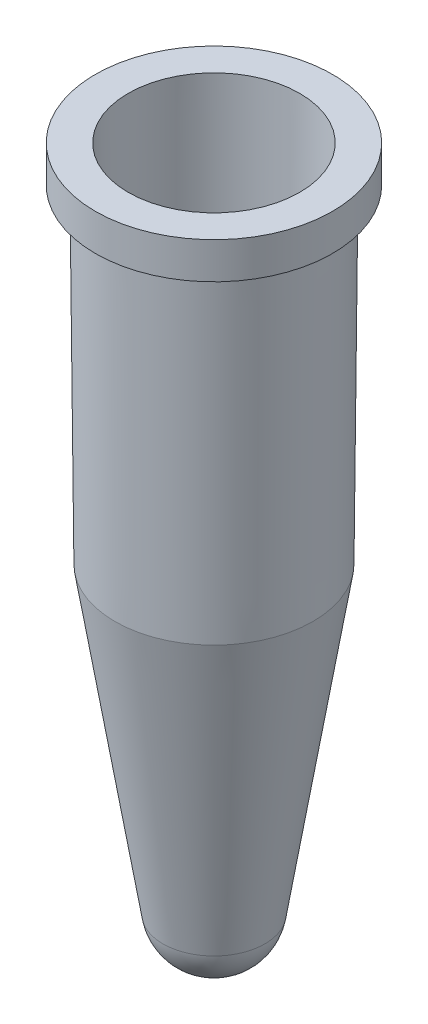
ISO-10303-21;
HEADER;
FILE_DESCRIPTION(('STEP AP214'),'2;1');
FILE_NAME('part.step','',(''),(''),'','','');
FILE_SCHEMA(('AUTOMOTIVE_DESIGN { 1 0 10303 214 1 1 1 1 }'));
ENDSEC;
DATA;
#1=APPLICATION_CONTEXT('core data for automotive mechanical design processes');
#2=APPLICATION_PROTOCOL_DEFINITION('international standard','automotive_design',2000,#1);
#3=PRODUCT_CONTEXT('',#1,'mechanical');
#4=PRODUCT('Part','Part','',(#3));
#5=PRODUCT_RELATED_PRODUCT_CATEGORY('part','',(#4));
#6=PRODUCT_DEFINITION_FORMATION('','',#4);
#7=PRODUCT_DEFINITION_CONTEXT('part definition',#1,'design');
#8=PRODUCT_DEFINITION('design','',#6,#7);
#9=PRODUCT_DEFINITION_SHAPE('','',#8);
#10=(LENGTH_UNIT() NAMED_UNIT(*) SI_UNIT(.MILLI.,.METRE.));
#11=(NAMED_UNIT(*) PLANE_ANGLE_UNIT() SI_UNIT($,.RADIAN.));
#12=(NAMED_UNIT(*) SI_UNIT($,.STERADIAN.) SOLID_ANGLE_UNIT());
#13=UNCERTAINTY_MEASURE_WITH_UNIT(LENGTH_MEASURE(1.E-05),#10,'distance_accuracy_value','');
#14=(GEOMETRIC_REPRESENTATION_CONTEXT(3) GLOBAL_UNCERTAINTY_ASSIGNED_CONTEXT((#13)) GLOBAL_UNIT_ASSIGNED_CONTEXT((#10,
#11,#12)) REPRESENTATION_CONTEXT('',''));
#15=CARTESIAN_POINT('',(0.,0.,0.));
#16=DIRECTION('',(0.,0.,1.));
#17=DIRECTION('',(1.,0.,0.));
#18=AXIS2_PLACEMENT_3D('',#15,#16,#17);
#19=CARTESIAN_POINT('',(0.,-26.3041786125045,0.));
#20=DIRECTION('',(0.,1.,0.));
#21=DIRECTION('',(-1.,0.,0.));
#22=AXIS2_PLACEMENT_3D('',#19,#20,#21);
#23=SPHERICAL_SURFACE('',#22,0.985472906829901);
#24=CARTESIAN_POINT('',(0.,-26.4583405394961,0.));
#25=DIRECTION('',(0.,1.,0.));
#26=DIRECTION('',(0.,0.,1.));
#27=AXIS2_PLACEMENT_3D('',#24,#25,#26);
#28=CIRCLE('',#27,0.973340100048291);
#29=CARTESIAN_POINT('',(0.,-26.4583405394961,0.973340100048291));
#30=VERTEX_POINT('',#29);
#31=EDGE_CURVE('E10',#30,#30,#28,.T.);
#32=ORIENTED_EDGE('',*,*,#31,.T.);
#33=EDGE_LOOP('',(#32));
#34=FACE_BOUND('',#33,.T.);
#35=ADVANCED_FACE('F40',(#34),#23,.F.);
#36=CARTESIAN_POINT('',(0.,-18.0046720237706,0.));
#37=DIRECTION('',(0.,1.,0.));
#38=DIRECTION('',(0.,0.,1.));
#39=AXIS2_PLACEMENT_3D('',#36,#37,#38);
#40=CONICAL_SURFACE('',#39,2.31226965660062,0.15707963267949);
#41=ORIENTED_EDGE('',*,*,#31,.F.);
#42=EDGE_LOOP('',(#41));
#43=FACE_BOUND('',#42,.T.);
#44=CARTESIAN_POINT('',(0.,-18.0046720237706,0.));
#45=DIRECTION('',(0.,1.,0.));
#46=DIRECTION('',(0.,0.,1.));
#47=AXIS2_PLACEMENT_3D('',#44,#45,#46);
#48=CIRCLE('',#47,2.31226965660062);
#49=CARTESIAN_POINT('',(0.,-18.0046720237706,2.31226965660062));
#50=VERTEX_POINT('',#49);
#51=EDGE_CURVE('E47',#50,#50,#48,.T.);
#52=ORIENTED_EDGE('',*,*,#51,.T.);
#53=EDGE_LOOP('',(#52));
#54=FACE_BOUND('',#53,.T.);
#55=ADVANCED_FACE('F92',(#43,#54),#40,.F.);
#56=CARTESIAN_POINT('',(0.,-7.8253919368824,0.));
#57=DIRECTION('',(0.,1.,0.));
#58=DIRECTION('',(0.,0.,1.));
#59=AXIS2_PLACEMENT_3D('',#56,#57,#58);
#60=CONICAL_SURFACE('',#59,2.401102888124,0.00872664625997157);
#61=ORIENTED_EDGE('',*,*,#51,.F.);
#62=EDGE_LOOP('',(#61));
#63=FACE_BOUND('',#62,.T.);
#64=CARTESIAN_POINT('',(0.,-7.8253919368824,0.));
#65=DIRECTION('',(0.,1.,0.));
#66=DIRECTION('',(0.,0.,1.));
#67=AXIS2_PLACEMENT_3D('',#64,#65,#66);
#68=CIRCLE('',#67,2.401102888124);
#69=CARTESIAN_POINT('',(0.,-7.8253919368824,2.401102888124));
#70=VERTEX_POINT('',#69);
#71=EDGE_CURVE('E52',#70,#70,#68,.T.);
#72=ORIENTED_EDGE('',*,*,#71,.T.);
#73=EDGE_LOOP('',(#72));
#74=FACE_BOUND('',#73,.T.);
#75=ADVANCED_FACE('F96',(#63,#74),#60,.F.);
#76=CARTESIAN_POINT('',(0.,-7.8253919368824,0.));
#77=DIRECTION('',(0.,1.,0.));
#78=DIRECTION('',(0.,0.,1.));
#79=AXIS2_PLACEMENT_3D('',#76,#77,#78);
#80=PLANE('',#79);
#81=CARTESIAN_POINT('',(0.,-7.8253919368824,0.));
#82=DIRECTION('',(0.,1.,0.));
#83=DIRECTION('',(0.,0.,1.));
#84=AXIS2_PLACEMENT_3D('',#81,#82,#83);
#85=CIRCLE('',#84,3.32067420698);
#86=CARTESIAN_POINT('',(0.,-7.8253919368824,3.32067420698));
#87=VERTEX_POINT('',#86);
#88=EDGE_CURVE('E57',#87,#87,#85,.T.);
#89=ORIENTED_EDGE('',*,*,#88,.T.);
#90=EDGE_LOOP('',(#89));
#91=FACE_BOUND('',#90,.T.);
#92=ORIENTED_EDGE('',*,*,#71,.F.);
#93=EDGE_LOOP('',(#92));
#94=FACE_BOUND('',#93,.T.);
#95=ADVANCED_FACE('F101',(#91,#94),#80,.T.);
#96=CARTESIAN_POINT('',(0.,-7.8253919368824,0.));
#97=DIRECTION('',(0.,1.,0.));
#98=DIRECTION('',(0.,0.,1.));
#99=AXIS2_PLACEMENT_3D('',#96,#97,#98);
#100=CYLINDRICAL_SURFACE('',#99,3.32067420698);
#101=CARTESIAN_POINT('',(0.,-8.8471378467224,0.));
#102=DIRECTION('',(0.,1.,0.));
#103=DIRECTION('',(0.,0.,1.));
#104=AXIS2_PLACEMENT_3D('',#101,#102,#103);
#105=CIRCLE('',#104,3.32067420698);
#106=CARTESIAN_POINT('',(0.,-8.8471378467224,3.32067420698));
#107=VERTEX_POINT('',#106);
#108=EDGE_CURVE('E63',#107,#107,#105,.T.);
#109=ORIENTED_EDGE('',*,*,#108,.T.);
#110=EDGE_LOOP('',(#109));
#111=FACE_BOUND('',#110,.T.);
#112=ORIENTED_EDGE('',*,*,#88,.F.);
#113=EDGE_LOOP('',(#112));
#114=FACE_BOUND('',#113,.T.);
#115=ADVANCED_FACE('F107',(#111,#114),#100,.T.);
#116=CARTESIAN_POINT('',(0.,-8.8471378467224,0.));
#117=DIRECTION('',(0.,-1.,0.));
#118=DIRECTION('',(0.,0.,-1.));
#119=AXIS2_PLACEMENT_3D('',#116,#117,#118);
#120=PLANE('',#119);
#121=CARTESIAN_POINT('',(0.,-8.8471378467224,0.));
#122=DIRECTION('',(0.,1.,0.));
#123=DIRECTION('',(0.,0.,1.));
#124=AXIS2_PLACEMENT_3D('',#121,#122,#123);
#125=CIRCLE('',#124,2.85198941397677);
#126=CARTESIAN_POINT('',(0.,-8.8471378467224,2.85198941397677));
#127=VERTEX_POINT('',#126);
#128=EDGE_CURVE('E67',#127,#127,#125,.T.);
#129=ORIENTED_EDGE('',*,*,#128,.T.);
#130=EDGE_LOOP('',(#129));
#131=FACE_BOUND('',#130,.T.);
#132=ORIENTED_EDGE('',*,*,#108,.F.);
#133=EDGE_LOOP('',(#132));
#134=FACE_BOUND('',#133,.T.);
#135=ADVANCED_FACE('F111',(#131,#134),#120,.T.);
#136=CARTESIAN_POINT('',(0.,-8.8471378467224,0.));
#137=DIRECTION('',(0.,1.,0.));
#138=DIRECTION('',(0.,0.,1.));
#139=AXIS2_PLACEMENT_3D('',#136,#137,#138);
#140=CONICAL_SURFACE('',#139,2.85198941397677,0.00872664625997156);
#141=CARTESIAN_POINT('',(0.,-18.0428510352824,0.));
#142=DIRECTION('',(0.,1.,0.));
#143=DIRECTION('',(0.,0.,1.));
#144=AXIS2_PLACEMENT_3D('',#141,#142,#143);
#145=CIRCLE('',#144,2.77173964073847);
#146=CARTESIAN_POINT('',(0.,-18.0428510352824,2.77173964073847));
#147=VERTEX_POINT('',#146);
#148=EDGE_CURVE('E71',#147,#147,#145,.T.);
#149=ORIENTED_EDGE('',*,*,#148,.T.);
#150=EDGE_LOOP('',(#149));
#151=FACE_BOUND('',#150,.T.);
#152=ORIENTED_EDGE('',*,*,#128,.F.);
#153=EDGE_LOOP('',(#152));
#154=FACE_BOUND('',#153,.T.);
#155=ADVANCED_FACE('F89',(#151,#154),#140,.T.);
#156=CARTESIAN_POINT('',(0.,-18.0428510352824,0.));
#157=DIRECTION('',(0.,1.,0.));
#158=DIRECTION('',(0.,0.,1.));
#159=AXIS2_PLACEMENT_3D('',#156,#157,#158);
#160=CONICAL_SURFACE('',#159,2.77173964073847,0.15707963267949);
#161=CARTESIAN_POINT('',(0.,-26.5302668631619,0.));
#162=DIRECTION('',(0.,1.,0.));
#163=DIRECTION('',(0.,0.,1.));
#164=AXIS2_PLACEMENT_3D('',#161,#162,#163);
#165=CIRCLE('',#164,1.42746503503817);
#166=CARTESIAN_POINT('',(0.,-26.5302668631619,1.42746503503817));
#167=VERTEX_POINT('',#166);
#168=EDGE_CURVE('E75',#167,#167,#165,.T.);
#169=ORIENTED_EDGE('',*,*,#168,.T.);
#170=EDGE_LOOP('',(#169));
#171=FACE_BOUND('',#170,.T.);
#172=ORIENTED_EDGE('',*,*,#148,.F.);
#173=EDGE_LOOP('',(#172));
#174=FACE_BOUND('',#173,.T.);
#175=ADVANCED_FACE('F80',(#171,#174),#160,.T.);
#176=CARTESIAN_POINT('',(0.,-26.3041786125045,0.));
#177=DIRECTION('',(0.,1.,0.));
#178=DIRECTION('',(-1.,0.,0.));
#179=AXIS2_PLACEMENT_3D('',#176,#177,#178);
#180=SPHERICAL_SURFACE('',#179,1.4452585662579);
#181=ORIENTED_EDGE('',*,*,#168,.F.);
#182=EDGE_LOOP('',(#181));
#183=FACE_BOUND('',#182,.T.);
#184=ADVANCED_FACE('F83',(#183),#180,.T.);
#185=CLOSED_SHELL('',(#35,#55,#75,#95,#115,#135,#155,#175,#184));
#186=MANIFOLD_SOLID_BREP('B2',#185);
#187=ADVANCED_BREP_SHAPE_REPRESENTATION('',(#18,#186),#14);
#188=SHAPE_DEFINITION_REPRESENTATION(#9,#187);
ENDSEC;
END-ISO-10303-21;
